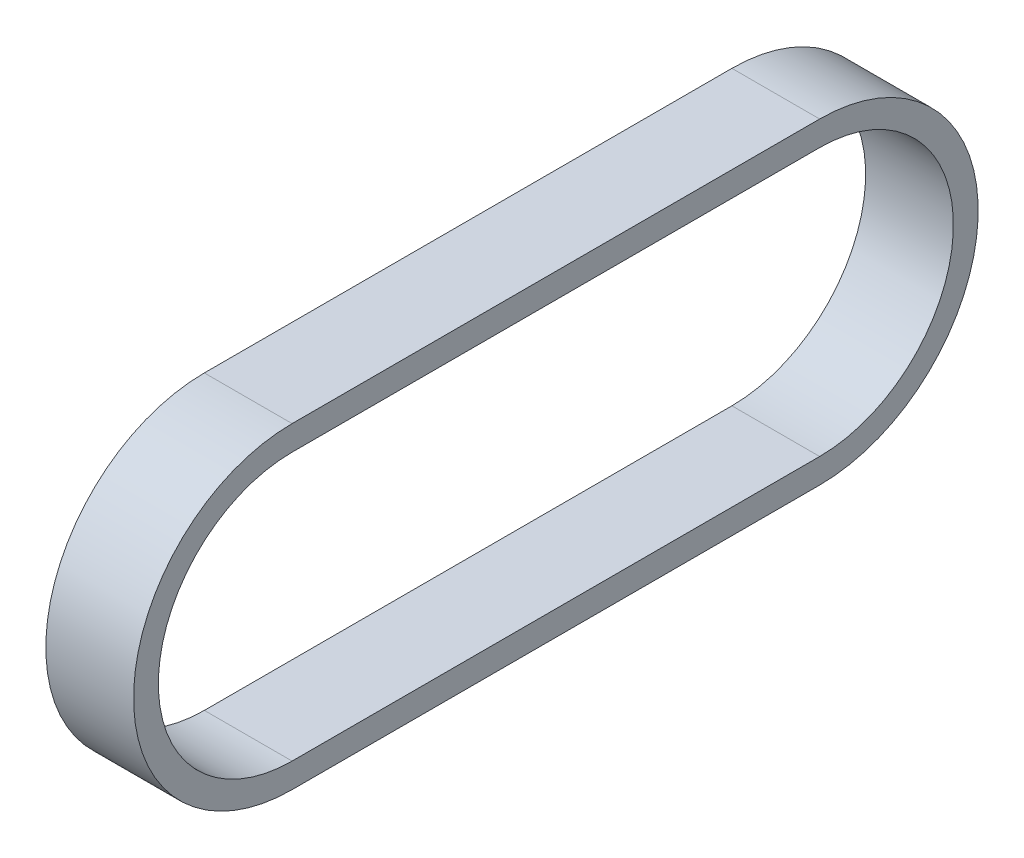
ISO-10303-21;
HEADER;
FILE_DESCRIPTION(('STEP AP214'),'2;1');
FILE_NAME('part.step','',(''),(''),'','','');
FILE_SCHEMA(('AUTOMOTIVE_DESIGN { 1 0 10303 214 1 1 1 1 }'));
ENDSEC;
DATA;
#1=APPLICATION_CONTEXT('core data for automotive mechanical design processes');
#2=APPLICATION_PROTOCOL_DEFINITION('international standard','automotive_design',2000,#1);
#3=PRODUCT_CONTEXT('',#1,'mechanical');
#4=PRODUCT('Part','Part','',(#3));
#5=PRODUCT_RELATED_PRODUCT_CATEGORY('part','',(#4));
#6=PRODUCT_DEFINITION_FORMATION('','',#4);
#7=PRODUCT_DEFINITION_CONTEXT('part definition',#1,'design');
#8=PRODUCT_DEFINITION('design','',#6,#7);
#9=PRODUCT_DEFINITION_SHAPE('','',#8);
#10=(LENGTH_UNIT() NAMED_UNIT(*) SI_UNIT(.MILLI.,.METRE.));
#11=(NAMED_UNIT(*) PLANE_ANGLE_UNIT() SI_UNIT($,.RADIAN.));
#12=(NAMED_UNIT(*) SI_UNIT($,.STERADIAN.) SOLID_ANGLE_UNIT());
#13=UNCERTAINTY_MEASURE_WITH_UNIT(LENGTH_MEASURE(1.E-05),#10,'distance_accuracy_value','');
#14=(GEOMETRIC_REPRESENTATION_CONTEXT(3) GLOBAL_UNCERTAINTY_ASSIGNED_CONTEXT((#13)) GLOBAL_UNIT_ASSIGNED_CONTEXT((#10,
#11,#12)) REPRESENTATION_CONTEXT('',''));
#15=CARTESIAN_POINT('',(0.,0.,0.));
#16=DIRECTION('',(0.,0.,1.));
#17=DIRECTION('',(1.,0.,0.));
#18=AXIS2_PLACEMENT_3D('',#15,#16,#17);
#19=CARTESIAN_POINT('',(9.,0.,0.));
#20=DIRECTION('',(1.,0.,0.));
#21=DIRECTION('',(0.,0.,-1.));
#22=AXIS2_PLACEMENT_3D('',#19,#20,#21);
#23=PLANE('',#22);
#24=CARTESIAN_POINT('',(9.,0.,0.));
#25=DIRECTION('',(1.,0.,0.));
#26=DIRECTION('',(0.,0.,-1.));
#27=AXIS2_PLACEMENT_3D('',#24,#25,#26);
#28=CIRCLE('',#27,16.256);
#29=CARTESIAN_POINT('',(9.,16.256,0.));
#30=VERTEX_POINT('',#29);
#31=CARTESIAN_POINT('',(9.,-16.256,0.));
#32=VERTEX_POINT('',#31);
#33=EDGE_CURVE('E158',#30,#32,#28,.T.);
#34=ORIENTED_EDGE('',*,*,#33,.T.);
#35=DIRECTION('',(0.,0.,-1.));
#36=VECTOR('',#35,1.);
#37=CARTESIAN_POINT('',(9.,-16.256,0.));
#38=LINE('',#37,#36);
#39=CARTESIAN_POINT('',(9.,-16.256,-54.102));
#40=VERTEX_POINT('',#39);
#41=EDGE_CURVE('E161',#32,#40,#38,.T.);
#42=ORIENTED_EDGE('',*,*,#41,.T.);
#43=CARTESIAN_POINT('',(9.,0.,-54.102));
#44=DIRECTION('',(1.,0.,0.));
#45=DIRECTION('',(0.,0.,-1.));
#46=AXIS2_PLACEMENT_3D('',#43,#44,#45);
#47=CIRCLE('',#46,16.256);
#48=CARTESIAN_POINT('',(9.,16.256,-54.102));
#49=VERTEX_POINT('',#48);
#50=EDGE_CURVE('E164',#40,#49,#47,.T.);
#51=ORIENTED_EDGE('',*,*,#50,.T.);
#52=DIRECTION('',(0.,0.,1.));
#53=VECTOR('',#52,1.);
#54=CARTESIAN_POINT('',(9.,16.256,0.));
#55=LINE('',#54,#53);
#56=EDGE_CURVE('E166',#49,#30,#55,.T.);
#57=ORIENTED_EDGE('',*,*,#56,.T.);
#58=EDGE_LOOP('',(#34,#42,#51,#57));
#59=FACE_BOUND('',#58,.T.);
#60=DIRECTION('',(0.,0.,-1.));
#61=VECTOR('',#60,1.);
#62=CARTESIAN_POINT('',(9.,-13.716,0.));
#63=LINE('',#62,#61);
#64=CARTESIAN_POINT('',(9.,-13.716,0.));
#65=VERTEX_POINT('',#64);
#66=CARTESIAN_POINT('',(9.,-13.716,-54.102));
#67=VERTEX_POINT('',#66);
#68=EDGE_CURVE('E130',#65,#67,#63,.T.);
#69=ORIENTED_EDGE('',*,*,#68,.F.);
#70=CARTESIAN_POINT('',(9.,0.,0.));
#71=DIRECTION('',(1.,0.,0.));
#72=DIRECTION('',(0.,0.,-1.));
#73=AXIS2_PLACEMENT_3D('',#70,#71,#72);
#74=CIRCLE('',#73,13.716);
#75=CARTESIAN_POINT('',(9.,13.716,0.));
#76=VERTEX_POINT('',#75);
#77=EDGE_CURVE('E122',#76,#65,#74,.T.);
#78=ORIENTED_EDGE('',*,*,#77,.F.);
#79=DIRECTION('',(0.,0.,1.));
#80=VECTOR('',#79,1.);
#81=CARTESIAN_POINT('',(9.,13.716,0.));
#82=LINE('',#81,#80);
#83=CARTESIAN_POINT('',(9.,13.716,-54.102));
#84=VERTEX_POINT('',#83);
#85=EDGE_CURVE('E144',#84,#76,#82,.T.);
#86=ORIENTED_EDGE('',*,*,#85,.F.);
#87=CARTESIAN_POINT('',(9.,0.,-54.102));
#88=DIRECTION('',(1.,0.,0.));
#89=DIRECTION('',(0.,0.,-1.));
#90=AXIS2_PLACEMENT_3D('',#87,#88,#89);
#91=CIRCLE('',#90,13.716);
#92=EDGE_CURVE('E142',#67,#84,#91,.T.);
#93=ORIENTED_EDGE('',*,*,#92,.F.);
#94=EDGE_LOOP('',(#69,#78,#86,#93));
#95=FACE_BOUND('',#94,.T.);
#96=ADVANCED_FACE('F57',(#59,#95),#23,.T.);
#97=CARTESIAN_POINT('',(0.,0.,0.));
#98=DIRECTION('',(1.,0.,0.));
#99=DIRECTION('',(0.,0.,-1.));
#100=AXIS2_PLACEMENT_3D('',#97,#98,#99);
#101=PLANE('',#100);
#102=CARTESIAN_POINT('',(0.,0.,0.));
#103=DIRECTION('',(1.,0.,0.));
#104=DIRECTION('',(0.,0.,-1.));
#105=AXIS2_PLACEMENT_3D('',#102,#103,#104);
#106=CIRCLE('',#105,16.256);
#107=CARTESIAN_POINT('',(0.,16.256,0.));
#108=VERTEX_POINT('',#107);
#109=CARTESIAN_POINT('',(0.,-16.256,0.));
#110=VERTEX_POINT('',#109);
#111=EDGE_CURVE('E138',#108,#110,#106,.T.);
#112=ORIENTED_EDGE('',*,*,#111,.F.);
#113=DIRECTION('',(0.,0.,1.));
#114=VECTOR('',#113,1.);
#115=CARTESIAN_POINT('',(0.,16.256,0.));
#116=LINE('',#115,#114);
#117=CARTESIAN_POINT('',(0.,16.256,-54.102));
#118=VERTEX_POINT('',#117);
#119=EDGE_CURVE('E162',#118,#108,#116,.T.);
#120=ORIENTED_EDGE('',*,*,#119,.F.);
#121=CARTESIAN_POINT('',(0.,0.,-54.102));
#122=DIRECTION('',(1.,0.,0.));
#123=DIRECTION('',(0.,0.,-1.));
#124=AXIS2_PLACEMENT_3D('',#121,#122,#123);
#125=CIRCLE('',#124,16.256);
#126=CARTESIAN_POINT('',(0.,-16.256,-54.102));
#127=VERTEX_POINT('',#126);
#128=EDGE_CURVE('E173',#127,#118,#125,.T.);
#129=ORIENTED_EDGE('',*,*,#128,.F.);
#130=DIRECTION('',(0.,0.,-1.));
#131=VECTOR('',#130,1.);
#132=CARTESIAN_POINT('',(0.,-16.256,0.));
#133=LINE('',#132,#131);
#134=EDGE_CURVE('E171',#110,#127,#133,.T.);
#135=ORIENTED_EDGE('',*,*,#134,.F.);
#136=EDGE_LOOP('',(#112,#120,#129,#135));
#137=FACE_BOUND('',#136,.T.);
#138=CARTESIAN_POINT('',(0.,0.,0.));
#139=DIRECTION('',(1.,0.,0.));
#140=DIRECTION('',(0.,0.,-1.));
#141=AXIS2_PLACEMENT_3D('',#138,#139,#140);
#142=CIRCLE('',#141,13.716);
#143=CARTESIAN_POINT('',(0.,13.716,0.));
#144=VERTEX_POINT('',#143);
#145=CARTESIAN_POINT('',(0.,-13.716,0.));
#146=VERTEX_POINT('',#145);
#147=EDGE_CURVE('E80',#144,#146,#142,.T.);
#148=ORIENTED_EDGE('',*,*,#147,.T.);
#149=DIRECTION('',(0.,0.,-1.));
#150=VECTOR('',#149,1.);
#151=CARTESIAN_POINT('',(0.,-13.716,0.));
#152=LINE('',#151,#150);
#153=CARTESIAN_POINT('',(0.,-13.716,-54.102));
#154=VERTEX_POINT('',#153);
#155=EDGE_CURVE('E137',#146,#154,#152,.T.);
#156=ORIENTED_EDGE('',*,*,#155,.T.);
#157=CARTESIAN_POINT('',(0.,0.,-54.102));
#158=DIRECTION('',(1.,0.,0.));
#159=DIRECTION('',(0.,0.,-1.));
#160=AXIS2_PLACEMENT_3D('',#157,#158,#159);
#161=CIRCLE('',#160,13.716);
#162=CARTESIAN_POINT('',(0.,13.716,-54.102));
#163=VERTEX_POINT('',#162);
#164=EDGE_CURVE('E150',#154,#163,#161,.T.);
#165=ORIENTED_EDGE('',*,*,#164,.T.);
#166=DIRECTION('',(0.,0.,1.));
#167=VECTOR('',#166,1.);
#168=CARTESIAN_POINT('',(0.,13.716,0.));
#169=LINE('',#168,#167);
#170=EDGE_CURVE('E131',#163,#144,#169,.T.);
#171=ORIENTED_EDGE('',*,*,#170,.T.);
#172=EDGE_LOOP('',(#148,#156,#165,#171));
#173=FACE_BOUND('',#172,.T.);
#174=ADVANCED_FACE('F191',(#137,#173),#101,.F.);
#175=CARTESIAN_POINT('',(9.,0.,0.));
#176=DIRECTION('',(-1.,0.,0.));
#177=DIRECTION('',(0.,0.,1.));
#178=AXIS2_PLACEMENT_3D('',#175,#176,#177);
#179=CYLINDRICAL_SURFACE('',#178,16.256);
#180=ORIENTED_EDGE('',*,*,#111,.T.);
#181=DIRECTION('',(-1.,0.,0.));
#182=VECTOR('',#181,1.);
#183=CARTESIAN_POINT('',(9.,-16.256,0.));
#184=LINE('',#183,#182);
#185=EDGE_CURVE('E12',#32,#110,#184,.T.);
#186=ORIENTED_EDGE('',*,*,#185,.F.);
#187=ORIENTED_EDGE('',*,*,#33,.F.);
#188=DIRECTION('',(-1.,0.,0.));
#189=VECTOR('',#188,1.);
#190=CARTESIAN_POINT('',(9.,16.256,0.));
#191=LINE('',#190,#189);
#192=EDGE_CURVE('E168',#30,#108,#191,.T.);
#193=ORIENTED_EDGE('',*,*,#192,.T.);
#194=EDGE_LOOP('',(#180,#186,#187,#193));
#195=FACE_BOUND('',#194,.T.);
#196=ADVANCED_FACE('F59',(#195),#179,.T.);
#197=CARTESIAN_POINT('',(9.,-16.256,0.));
#198=DIRECTION('',(0.,1.,0.));
#199=DIRECTION('',(0.,0.,1.));
#200=AXIS2_PLACEMENT_3D('',#197,#198,#199);
#201=PLANE('',#200);
#202=ORIENTED_EDGE('',*,*,#134,.T.);
#203=DIRECTION('',(-1.,0.,0.));
#204=VECTOR('',#203,1.);
#205=CARTESIAN_POINT('',(9.,-16.256,-54.102));
#206=LINE('',#205,#204);
#207=EDGE_CURVE('E65',#40,#127,#206,.T.);
#208=ORIENTED_EDGE('',*,*,#207,.F.);
#209=ORIENTED_EDGE('',*,*,#41,.F.);
#210=ORIENTED_EDGE('',*,*,#185,.T.);
#211=EDGE_LOOP('',(#202,#208,#209,#210));
#212=FACE_BOUND('',#211,.T.);
#213=ADVANCED_FACE('F201',(#212),#201,.F.);
#214=CARTESIAN_POINT('',(9.,0.,-54.102));
#215=DIRECTION('',(-1.,0.,0.));
#216=DIRECTION('',(0.,0.,1.));
#217=AXIS2_PLACEMENT_3D('',#214,#215,#216);
#218=CYLINDRICAL_SURFACE('',#217,16.256);
#219=ORIENTED_EDGE('',*,*,#128,.T.);
#220=DIRECTION('',(-1.,0.,0.));
#221=VECTOR('',#220,1.);
#222=CARTESIAN_POINT('',(9.,16.256,-54.102));
#223=LINE('',#222,#221);
#224=EDGE_CURVE('E178',#49,#118,#223,.T.);
#225=ORIENTED_EDGE('',*,*,#224,.F.);
#226=ORIENTED_EDGE('',*,*,#50,.F.);
#227=ORIENTED_EDGE('',*,*,#207,.T.);
#228=EDGE_LOOP('',(#219,#225,#226,#227));
#229=FACE_BOUND('',#228,.T.);
#230=ADVANCED_FACE('F185',(#229),#218,.T.);
#231=CARTESIAN_POINT('',(9.,16.256,0.));
#232=DIRECTION('',(0.,-1.,0.));
#233=DIRECTION('',(0.,0.,-1.));
#234=AXIS2_PLACEMENT_3D('',#231,#232,#233);
#235=PLANE('',#234);
#236=ORIENTED_EDGE('',*,*,#119,.T.);
#237=ORIENTED_EDGE('',*,*,#192,.F.);
#238=ORIENTED_EDGE('',*,*,#56,.F.);
#239=ORIENTED_EDGE('',*,*,#224,.T.);
#240=EDGE_LOOP('',(#236,#237,#238,#239));
#241=FACE_BOUND('',#240,.T.);
#242=ADVANCED_FACE('F195',(#241),#235,.F.);
#243=CARTESIAN_POINT('',(9.,0.,0.));
#244=DIRECTION('',(-1.,0.,0.));
#245=DIRECTION('',(0.,0.,1.));
#246=AXIS2_PLACEMENT_3D('',#243,#244,#245);
#247=CYLINDRICAL_SURFACE('',#246,13.716);
#248=ORIENTED_EDGE('',*,*,#147,.F.);
#249=DIRECTION('',(-1.,0.,0.));
#250=VECTOR('',#249,1.);
#251=CARTESIAN_POINT('',(9.,13.716,0.));
#252=LINE('',#251,#250);
#253=EDGE_CURVE('E126',#76,#144,#252,.T.);
#254=ORIENTED_EDGE('',*,*,#253,.F.);
#255=ORIENTED_EDGE('',*,*,#77,.T.);
#256=DIRECTION('',(-1.,0.,0.));
#257=VECTOR('',#256,1.);
#258=CARTESIAN_POINT('',(9.,-13.716,0.));
#259=LINE('',#258,#257);
#260=EDGE_CURVE('E125',#65,#146,#259,.T.);
#261=ORIENTED_EDGE('',*,*,#260,.T.);
#262=EDGE_LOOP('',(#248,#254,#255,#261));
#263=FACE_BOUND('',#262,.T.);
#264=ADVANCED_FACE('F124',(#263),#247,.F.);
#265=CARTESIAN_POINT('',(9.,-13.716,0.));
#266=DIRECTION('',(0.,1.,0.));
#267=DIRECTION('',(0.,0.,1.));
#268=AXIS2_PLACEMENT_3D('',#265,#266,#267);
#269=PLANE('',#268);
#270=ORIENTED_EDGE('',*,*,#155,.F.);
#271=ORIENTED_EDGE('',*,*,#260,.F.);
#272=ORIENTED_EDGE('',*,*,#68,.T.);
#273=DIRECTION('',(-1.,0.,0.));
#274=VECTOR('',#273,1.);
#275=CARTESIAN_POINT('',(9.,-13.716,-54.102));
#276=LINE('',#275,#274);
#277=EDGE_CURVE('E139',#67,#154,#276,.T.);
#278=ORIENTED_EDGE('',*,*,#277,.T.);
#279=EDGE_LOOP('',(#270,#271,#272,#278));
#280=FACE_BOUND('',#279,.T.);
#281=ADVANCED_FACE('F134',(#280),#269,.T.);
#282=CARTESIAN_POINT('',(9.,0.,-54.102));
#283=DIRECTION('',(-1.,0.,0.));
#284=DIRECTION('',(0.,0.,1.));
#285=AXIS2_PLACEMENT_3D('',#282,#283,#284);
#286=CYLINDRICAL_SURFACE('',#285,13.716);
#287=ORIENTED_EDGE('',*,*,#164,.F.);
#288=ORIENTED_EDGE('',*,*,#277,.F.);
#289=ORIENTED_EDGE('',*,*,#92,.T.);
#290=DIRECTION('',(-1.,0.,0.));
#291=VECTOR('',#290,1.);
#292=CARTESIAN_POINT('',(9.,13.716,-54.102));
#293=LINE('',#292,#291);
#294=EDGE_CURVE('E72',#84,#163,#293,.T.);
#295=ORIENTED_EDGE('',*,*,#294,.T.);
#296=EDGE_LOOP('',(#287,#288,#289,#295));
#297=FACE_BOUND('',#296,.T.);
#298=ADVANCED_FACE('F224',(#297),#286,.F.);
#299=CARTESIAN_POINT('',(9.,13.716,0.));
#300=DIRECTION('',(0.,-1.,0.));
#301=DIRECTION('',(0.,0.,-1.));
#302=AXIS2_PLACEMENT_3D('',#299,#300,#301);
#303=PLANE('',#302);
#304=ORIENTED_EDGE('',*,*,#170,.F.);
#305=ORIENTED_EDGE('',*,*,#294,.F.);
#306=ORIENTED_EDGE('',*,*,#85,.T.);
#307=ORIENTED_EDGE('',*,*,#253,.T.);
#308=EDGE_LOOP('',(#304,#305,#306,#307));
#309=FACE_BOUND('',#308,.T.);
#310=ADVANCED_FACE('F228',(#309),#303,.T.);
#311=CLOSED_SHELL('',(#96,#174,#196,#213,#230,#242,#264,#281,#298,#310));
#312=MANIFOLD_SOLID_BREP('B2',#311);
#313=ADVANCED_BREP_SHAPE_REPRESENTATION('',(#18,#312),#14);
#314=SHAPE_DEFINITION_REPRESENTATION(#9,#313);
ENDSEC;
END-ISO-10303-21;
